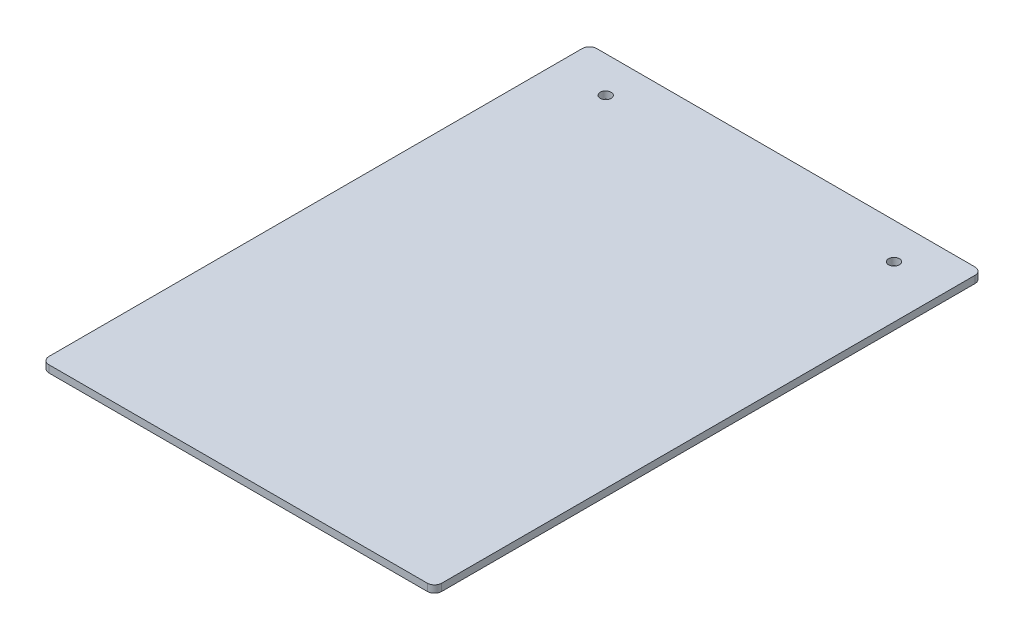
ISO-10303-21;
HEADER;
FILE_DESCRIPTION(('STEP AP214'),'2;1');
FILE_NAME('part.step','',(''),(''),'','','');
FILE_SCHEMA(('AUTOMOTIVE_DESIGN { 1 0 10303 214 1 1 1 1 }'));
ENDSEC;
DATA;
#1=APPLICATION_CONTEXT('core data for automotive mechanical design processes');
#2=APPLICATION_PROTOCOL_DEFINITION('international standard','automotive_design',2000,#1);
#3=PRODUCT_CONTEXT('',#1,'mechanical');
#4=PRODUCT('Part','Part','',(#3));
#5=PRODUCT_RELATED_PRODUCT_CATEGORY('part','',(#4));
#6=PRODUCT_DEFINITION_FORMATION('','',#4);
#7=PRODUCT_DEFINITION_CONTEXT('part definition',#1,'design');
#8=PRODUCT_DEFINITION('design','',#6,#7);
#9=PRODUCT_DEFINITION_SHAPE('','',#8);
#10=(LENGTH_UNIT() NAMED_UNIT(*) SI_UNIT(.MILLI.,.METRE.));
#11=(NAMED_UNIT(*) PLANE_ANGLE_UNIT() SI_UNIT($,.RADIAN.));
#12=(NAMED_UNIT(*) SI_UNIT($,.STERADIAN.) SOLID_ANGLE_UNIT());
#13=UNCERTAINTY_MEASURE_WITH_UNIT(LENGTH_MEASURE(1.E-05),#10,'distance_accuracy_value','');
#14=(GEOMETRIC_REPRESENTATION_CONTEXT(3) GLOBAL_UNCERTAINTY_ASSIGNED_CONTEXT((#13)) GLOBAL_UNIT_ASSIGNED_CONTEXT((#10,
#11,#12)) REPRESENTATION_CONTEXT('',''));
#15=CARTESIAN_POINT('',(0.,0.,0.));
#16=DIRECTION('',(0.,0.,1.));
#17=DIRECTION('',(1.,0.,0.));
#18=AXIS2_PLACEMENT_3D('',#15,#16,#17);
#19=CARTESIAN_POINT('',(173.0375,6.35,241.3));
#20=DIRECTION('',(-1.,0.,0.));
#21=DIRECTION('',(0.,0.,1.));
#22=AXIS2_PLACEMENT_3D('',#19,#20,#21);
#23=PLANE('',#22);
#24=DIRECTION('',(0.,0.,-1.));
#25=VECTOR('',#24,1.);
#26=CARTESIAN_POINT('',(173.0375,0.,241.3));
#27=LINE('',#26,#25);
#28=CARTESIAN_POINT('',(173.0375,0.,234.95));
#29=VERTEX_POINT('',#28);
#30=CARTESIAN_POINT('',(173.0375,0.,-234.95));
#31=VERTEX_POINT('',#30);
#32=EDGE_CURVE('E130',#29,#31,#27,.T.);
#33=ORIENTED_EDGE('',*,*,#32,.T.);
#34=DIRECTION('',(0.,-1.,0.));
#35=VECTOR('',#34,1.);
#36=CARTESIAN_POINT('',(173.0375,6.35,-234.95));
#37=LINE('',#36,#35);
#38=CARTESIAN_POINT('',(173.0375,6.35,-234.95));
#39=VERTEX_POINT('',#38);
#40=EDGE_CURVE('E108',#31,#39,#37,.F.);
#41=ORIENTED_EDGE('',*,*,#40,.T.);
#42=DIRECTION('',(0.,0.,-1.));
#43=VECTOR('',#42,1.);
#44=CARTESIAN_POINT('',(173.0375,6.35,241.3));
#45=LINE('',#44,#43);
#46=CARTESIAN_POINT('',(173.0375,6.35,234.95));
#47=VERTEX_POINT('',#46);
#48=EDGE_CURVE('E140',#47,#39,#45,.T.);
#49=ORIENTED_EDGE('',*,*,#48,.F.);
#50=DIRECTION('',(0.,-1.,0.));
#51=VECTOR('',#50,1.);
#52=CARTESIAN_POINT('',(173.0375,6.35,234.95));
#53=LINE('',#52,#51);
#54=EDGE_CURVE('E113',#47,#29,#53,.T.);
#55=ORIENTED_EDGE('',*,*,#54,.T.);
#56=EDGE_LOOP('',(#33,#41,#49,#55));
#57=FACE_BOUND('',#56,.T.);
#58=ADVANCED_FACE('F37',(#57),#23,.F.);
#59=CARTESIAN_POINT('',(-173.0375,6.35,-241.3));
#60=DIRECTION('',(0.,0.,1.));
#61=DIRECTION('',(1.,0.,0.));
#62=AXIS2_PLACEMENT_3D('',#59,#60,#61);
#63=PLANE('',#62);
#64=DIRECTION('',(-1.,0.,0.));
#65=VECTOR('',#64,1.);
#66=CARTESIAN_POINT('',(-173.0375,6.35,-241.3));
#67=LINE('',#66,#65);
#68=CARTESIAN_POINT('',(166.6875,6.35,-241.3));
#69=VERTEX_POINT('',#68);
#70=CARTESIAN_POINT('',(-166.6875,6.35,-241.3));
#71=VERTEX_POINT('',#70);
#72=EDGE_CURVE('E123',#69,#71,#67,.T.);
#73=ORIENTED_EDGE('',*,*,#72,.F.);
#74=DIRECTION('',(0.,-1.,0.));
#75=VECTOR('',#74,1.);
#76=CARTESIAN_POINT('',(166.6875,6.35,-241.3));
#77=LINE('',#76,#75);
#78=CARTESIAN_POINT('',(166.6875,0.,-241.3));
#79=VERTEX_POINT('',#78);
#80=EDGE_CURVE('E107',#69,#79,#77,.T.);
#81=ORIENTED_EDGE('',*,*,#80,.T.);
#82=DIRECTION('',(-1.,0.,0.));
#83=VECTOR('',#82,1.);
#84=CARTESIAN_POINT('',(-173.0375,0.,-241.3));
#85=LINE('',#84,#83);
#86=CARTESIAN_POINT('',(-166.6875,0.,-241.3));
#87=VERTEX_POINT('',#86);
#88=EDGE_CURVE('E120',#79,#87,#85,.T.);
#89=ORIENTED_EDGE('',*,*,#88,.T.);
#90=DIRECTION('',(0.,-1.,0.));
#91=VECTOR('',#90,1.);
#92=CARTESIAN_POINT('',(-166.6875,6.35,-241.3));
#93=LINE('',#92,#91);
#94=EDGE_CURVE('E125',#87,#71,#93,.F.);
#95=ORIENTED_EDGE('',*,*,#94,.T.);
#96=EDGE_LOOP('',(#73,#81,#89,#95));
#97=FACE_BOUND('',#96,.T.);
#98=ADVANCED_FACE('F119',(#97),#63,.F.);
#99=CARTESIAN_POINT('',(-173.0375,6.35,241.3));
#100=DIRECTION('',(1.,0.,0.));
#101=DIRECTION('',(0.,0.,-1.));
#102=AXIS2_PLACEMENT_3D('',#99,#100,#101);
#103=PLANE('',#102);
#104=DIRECTION('',(0.,0.,1.));
#105=VECTOR('',#104,1.);
#106=CARTESIAN_POINT('',(-173.0375,6.35,241.3));
#107=LINE('',#106,#105);
#108=CARTESIAN_POINT('',(-173.0375,6.35,-234.95));
#109=VERTEX_POINT('',#108);
#110=CARTESIAN_POINT('',(-173.0375,6.35,234.95));
#111=VERTEX_POINT('',#110);
#112=EDGE_CURVE('E166',#109,#111,#107,.T.);
#113=ORIENTED_EDGE('',*,*,#112,.F.);
#114=DIRECTION('',(0.,-1.,0.));
#115=VECTOR('',#114,1.);
#116=CARTESIAN_POINT('',(-173.0375,6.35,-234.95));
#117=LINE('',#116,#115);
#118=CARTESIAN_POINT('',(-173.0375,0.,-234.95));
#119=VERTEX_POINT('',#118);
#120=EDGE_CURVE('E159',#109,#119,#117,.T.);
#121=ORIENTED_EDGE('',*,*,#120,.T.);
#122=DIRECTION('',(0.,0.,1.));
#123=VECTOR('',#122,1.);
#124=CARTESIAN_POINT('',(-173.0375,0.,241.3));
#125=LINE('',#124,#123);
#126=CARTESIAN_POINT('',(-173.0375,0.,234.95));
#127=VERTEX_POINT('',#126);
#128=EDGE_CURVE('E129',#119,#127,#125,.T.);
#129=ORIENTED_EDGE('',*,*,#128,.T.);
#130=DIRECTION('',(0.,-1.,0.));
#131=VECTOR('',#130,1.);
#132=CARTESIAN_POINT('',(-173.0375,6.35,234.95));
#133=LINE('',#132,#131);
#134=EDGE_CURVE('E157',#127,#111,#133,.F.);
#135=ORIENTED_EDGE('',*,*,#134,.T.);
#136=EDGE_LOOP('',(#113,#121,#129,#135));
#137=FACE_BOUND('',#136,.T.);
#138=ADVANCED_FACE('F164',(#137),#103,.F.);
#139=CARTESIAN_POINT('',(-173.0375,6.35,241.3));
#140=DIRECTION('',(0.,0.,-1.));
#141=DIRECTION('',(-1.,0.,0.));
#142=AXIS2_PLACEMENT_3D('',#139,#140,#141);
#143=PLANE('',#142);
#144=DIRECTION('',(1.,0.,0.));
#145=VECTOR('',#144,1.);
#146=CARTESIAN_POINT('',(-173.0375,6.35,241.3));
#147=LINE('',#146,#145);
#148=CARTESIAN_POINT('',(-166.6875,6.35,241.3));
#149=VERTEX_POINT('',#148);
#150=CARTESIAN_POINT('',(166.6875,6.35,241.3));
#151=VERTEX_POINT('',#150);
#152=EDGE_CURVE('E141',#149,#151,#147,.T.);
#153=ORIENTED_EDGE('',*,*,#152,.F.);
#154=DIRECTION('',(0.,-1.,0.));
#155=VECTOR('',#154,1.);
#156=CARTESIAN_POINT('',(-166.6875,6.35,241.3));
#157=LINE('',#156,#155);
#158=CARTESIAN_POINT('',(-166.6875,0.,241.3));
#159=VERTEX_POINT('',#158);
#160=EDGE_CURVE('E11',#149,#159,#157,.T.);
#161=ORIENTED_EDGE('',*,*,#160,.T.);
#162=DIRECTION('',(1.,0.,0.));
#163=VECTOR('',#162,1.);
#164=CARTESIAN_POINT('',(-173.0375,0.,241.3));
#165=LINE('',#164,#163);
#166=CARTESIAN_POINT('',(166.6875,0.,241.3));
#167=VERTEX_POINT('',#166);
#168=EDGE_CURVE('E133',#159,#167,#165,.T.);
#169=ORIENTED_EDGE('',*,*,#168,.T.);
#170=DIRECTION('',(0.,-1.,0.));
#171=VECTOR('',#170,1.);
#172=CARTESIAN_POINT('',(166.6875,6.35,241.3));
#173=LINE('',#172,#171);
#174=EDGE_CURVE('E45',#167,#151,#173,.F.);
#175=ORIENTED_EDGE('',*,*,#174,.T.);
#176=EDGE_LOOP('',(#153,#161,#169,#175));
#177=FACE_BOUND('',#176,.T.);
#178=ADVANCED_FACE('F173',(#177),#143,.F.);
#179=CARTESIAN_POINT('',(0.,6.35,0.));
#180=DIRECTION('',(0.,-1.,0.));
#181=DIRECTION('',(0.,0.,-1.));
#182=AXIS2_PLACEMENT_3D('',#179,#180,#181);
#183=PLANE('',#182);
#184=CARTESIAN_POINT('',(-127.,6.35,-209.55));
#185=DIRECTION('',(0.,1.,0.));
#186=DIRECTION('',(0.,0.,1.));
#187=AXIS2_PLACEMENT_3D('',#184,#185,#186);
#188=CIRCLE('',#187,4.76249999999999);
#189=CARTESIAN_POINT('',(-127.,6.35,-204.7875));
#190=VERTEX_POINT('',#189);
#191=EDGE_CURVE('E188',#190,#190,#188,.T.);
#192=ORIENTED_EDGE('',*,*,#191,.F.);
#193=EDGE_LOOP('',(#192));
#194=FACE_BOUND('',#193,.T.);
#195=CARTESIAN_POINT('',(127.,6.35,-209.55));
#196=DIRECTION('',(0.,1.,0.));
#197=DIRECTION('',(0.,0.,1.));
#198=AXIS2_PLACEMENT_3D('',#195,#196,#197);
#199=CIRCLE('',#198,4.7625);
#200=CARTESIAN_POINT('',(127.,6.35,-204.7875));
#201=VERTEX_POINT('',#200);
#202=EDGE_CURVE('E182',#201,#201,#199,.T.);
#203=ORIENTED_EDGE('',*,*,#202,.F.);
#204=EDGE_LOOP('',(#203));
#205=FACE_BOUND('',#204,.T.);
#206=ORIENTED_EDGE('',*,*,#48,.T.);
#207=CARTESIAN_POINT('',(166.6875,6.35,-234.95));
#208=DIRECTION('',(0.,-1.,0.));
#209=DIRECTION('',(0.,0.,-1.));
#210=AXIS2_PLACEMENT_3D('',#207,#208,#209);
#211=CIRCLE('',#210,6.35);
#212=EDGE_CURVE('E155',#39,#69,#211,.F.);
#213=ORIENTED_EDGE('',*,*,#212,.T.);
#214=ORIENTED_EDGE('',*,*,#72,.T.);
#215=CARTESIAN_POINT('',(-166.6875,6.35,-234.95));
#216=DIRECTION('',(0.,-1.,0.));
#217=DIRECTION('',(0.,0.,-1.));
#218=AXIS2_PLACEMENT_3D('',#215,#216,#217);
#219=CIRCLE('',#218,6.35);
#220=EDGE_CURVE('E153',#71,#109,#219,.F.);
#221=ORIENTED_EDGE('',*,*,#220,.T.);
#222=ORIENTED_EDGE('',*,*,#112,.T.);
#223=CARTESIAN_POINT('',(-166.6875,6.35,234.95));
#224=DIRECTION('',(0.,-1.,0.));
#225=DIRECTION('',(0.,0.,-1.));
#226=AXIS2_PLACEMENT_3D('',#223,#224,#225);
#227=CIRCLE('',#226,6.35);
#228=EDGE_CURVE('E58',#111,#149,#227,.F.);
#229=ORIENTED_EDGE('',*,*,#228,.T.);
#230=ORIENTED_EDGE('',*,*,#152,.T.);
#231=CARTESIAN_POINT('',(166.6875,6.35,234.95));
#232=DIRECTION('',(0.,-1.,0.));
#233=DIRECTION('',(0.,0.,-1.));
#234=AXIS2_PLACEMENT_3D('',#231,#232,#233);
#235=CIRCLE('',#234,6.35);
#236=EDGE_CURVE('E150',#151,#47,#235,.F.);
#237=ORIENTED_EDGE('',*,*,#236,.T.);
#238=EDGE_LOOP('',(#206,#213,#214,#221,#222,#229,#230,#237));
#239=FACE_BOUND('',#238,.T.);
#240=ADVANCED_FACE('F194',(#194,#205,#239),#183,.F.);
#241=CARTESIAN_POINT('',(0.,0.,0.));
#242=DIRECTION('',(0.,-1.,0.));
#243=DIRECTION('',(0.,0.,-1.));
#244=AXIS2_PLACEMENT_3D('',#241,#242,#243);
#245=PLANE('',#244);
#246=CARTESIAN_POINT('',(-127.,0.,-209.55));
#247=DIRECTION('',(0.,1.,0.));
#248=DIRECTION('',(0.,0.,1.));
#249=AXIS2_PLACEMENT_3D('',#246,#247,#248);
#250=CIRCLE('',#249,4.76249999999999);
#251=CARTESIAN_POINT('',(-127.,0.,-204.7875));
#252=VERTEX_POINT('',#251);
#253=EDGE_CURVE('E185',#252,#252,#250,.T.);
#254=ORIENTED_EDGE('',*,*,#253,.T.);
#255=EDGE_LOOP('',(#254));
#256=FACE_BOUND('',#255,.T.);
#257=CARTESIAN_POINT('',(127.,0.,-209.55));
#258=DIRECTION('',(0.,1.,0.));
#259=DIRECTION('',(0.,0.,1.));
#260=AXIS2_PLACEMENT_3D('',#257,#258,#259);
#261=CIRCLE('',#260,4.7625);
#262=CARTESIAN_POINT('',(127.,0.,-204.7875));
#263=VERTEX_POINT('',#262);
#264=EDGE_CURVE('E135',#263,#263,#261,.T.);
#265=ORIENTED_EDGE('',*,*,#264,.T.);
#266=EDGE_LOOP('',(#265));
#267=FACE_BOUND('',#266,.T.);
#268=ORIENTED_EDGE('',*,*,#88,.F.);
#269=CARTESIAN_POINT('',(166.6875,0.,-234.95));
#270=DIRECTION('',(0.,-1.,0.));
#271=DIRECTION('',(0.,0.,-1.));
#272=AXIS2_PLACEMENT_3D('',#269,#270,#271);
#273=CIRCLE('',#272,6.35);
#274=EDGE_CURVE('E103',#79,#31,#273,.T.);
#275=ORIENTED_EDGE('',*,*,#274,.T.);
#276=ORIENTED_EDGE('',*,*,#32,.F.);
#277=CARTESIAN_POINT('',(166.6875,0.,234.95));
#278=DIRECTION('',(0.,-1.,0.));
#279=DIRECTION('',(0.,0.,-1.));
#280=AXIS2_PLACEMENT_3D('',#277,#278,#279);
#281=CIRCLE('',#280,6.35);
#282=EDGE_CURVE('E124',#29,#167,#281,.T.);
#283=ORIENTED_EDGE('',*,*,#282,.T.);
#284=ORIENTED_EDGE('',*,*,#168,.F.);
#285=CARTESIAN_POINT('',(-166.6875,0.,234.95));
#286=DIRECTION('',(0.,-1.,0.));
#287=DIRECTION('',(0.,0.,-1.));
#288=AXIS2_PLACEMENT_3D('',#285,#286,#287);
#289=CIRCLE('',#288,6.35);
#290=EDGE_CURVE('E144',#159,#127,#289,.T.);
#291=ORIENTED_EDGE('',*,*,#290,.T.);
#292=ORIENTED_EDGE('',*,*,#128,.F.);
#293=CARTESIAN_POINT('',(-166.6875,0.,-234.95));
#294=DIRECTION('',(0.,-1.,0.));
#295=DIRECTION('',(0.,0.,-1.));
#296=AXIS2_PLACEMENT_3D('',#293,#294,#295);
#297=CIRCLE('',#296,6.35);
#298=EDGE_CURVE('E114',#119,#87,#297,.T.);
#299=ORIENTED_EDGE('',*,*,#298,.T.);
#300=EDGE_LOOP('',(#268,#275,#276,#283,#284,#291,#292,#299));
#301=FACE_BOUND('',#300,.T.);
#302=ADVANCED_FACE('F127',(#256,#267,#301),#245,.T.);
#303=CARTESIAN_POINT('',(166.6875,6.35,-234.95));
#304=DIRECTION('',(0.,-1.,0.));
#305=DIRECTION('',(0.,0.,-1.));
#306=AXIS2_PLACEMENT_3D('',#303,#304,#305);
#307=CYLINDRICAL_SURFACE('',#306,6.35);
#308=ORIENTED_EDGE('',*,*,#212,.F.);
#309=ORIENTED_EDGE('',*,*,#40,.F.);
#310=ORIENTED_EDGE('',*,*,#274,.F.);
#311=ORIENTED_EDGE('',*,*,#80,.F.);
#312=EDGE_LOOP('',(#308,#309,#310,#311));
#313=FACE_BOUND('',#312,.T.);
#314=ADVANCED_FACE('F106',(#313),#307,.T.);
#315=CARTESIAN_POINT('',(-166.6875,6.35,-234.95));
#316=DIRECTION('',(0.,-1.,0.));
#317=DIRECTION('',(0.,0.,-1.));
#318=AXIS2_PLACEMENT_3D('',#315,#316,#317);
#319=CYLINDRICAL_SURFACE('',#318,6.35);
#320=ORIENTED_EDGE('',*,*,#220,.F.);
#321=ORIENTED_EDGE('',*,*,#94,.F.);
#322=ORIENTED_EDGE('',*,*,#298,.F.);
#323=ORIENTED_EDGE('',*,*,#120,.F.);
#324=EDGE_LOOP('',(#320,#321,#322,#323));
#325=FACE_BOUND('',#324,.T.);
#326=ADVANCED_FACE('F211',(#325),#319,.T.);
#327=CARTESIAN_POINT('',(-166.6875,6.35,234.95));
#328=DIRECTION('',(0.,-1.,0.));
#329=DIRECTION('',(0.,0.,-1.));
#330=AXIS2_PLACEMENT_3D('',#327,#328,#329);
#331=CYLINDRICAL_SURFACE('',#330,6.35);
#332=ORIENTED_EDGE('',*,*,#228,.F.);
#333=ORIENTED_EDGE('',*,*,#134,.F.);
#334=ORIENTED_EDGE('',*,*,#290,.F.);
#335=ORIENTED_EDGE('',*,*,#160,.F.);
#336=EDGE_LOOP('',(#332,#333,#334,#335));
#337=FACE_BOUND('',#336,.T.);
#338=ADVANCED_FACE('F172',(#337),#331,.T.);
#339=CARTESIAN_POINT('',(166.6875,6.35,234.95));
#340=DIRECTION('',(0.,-1.,0.));
#341=DIRECTION('',(0.,0.,-1.));
#342=AXIS2_PLACEMENT_3D('',#339,#340,#341);
#343=CYLINDRICAL_SURFACE('',#342,6.35);
#344=ORIENTED_EDGE('',*,*,#236,.F.);
#345=ORIENTED_EDGE('',*,*,#174,.F.);
#346=ORIENTED_EDGE('',*,*,#282,.F.);
#347=ORIENTED_EDGE('',*,*,#54,.F.);
#348=EDGE_LOOP('',(#344,#345,#346,#347));
#349=FACE_BOUND('',#348,.T.);
#350=ADVANCED_FACE('F39',(#349),#343,.T.);
#351=CARTESIAN_POINT('',(127.,6.35,-209.55));
#352=DIRECTION('',(0.,1.,0.));
#353=DIRECTION('',(0.,0.,1.));
#354=AXIS2_PLACEMENT_3D('',#351,#352,#353);
#355=CYLINDRICAL_SURFACE('',#354,4.7625);
#356=ORIENTED_EDGE('',*,*,#264,.F.);
#357=EDGE_LOOP('',(#356));
#358=FACE_BOUND('',#357,.T.);
#359=ORIENTED_EDGE('',*,*,#202,.T.);
#360=EDGE_LOOP('',(#359));
#361=FACE_BOUND('',#360,.T.);
#362=ADVANCED_FACE('F204',(#358,#361),#355,.F.);
#363=CARTESIAN_POINT('',(-127.,6.35,-209.55));
#364=DIRECTION('',(0.,1.,0.));
#365=DIRECTION('',(0.,0.,1.));
#366=AXIS2_PLACEMENT_3D('',#363,#364,#365);
#367=CYLINDRICAL_SURFACE('',#366,4.76249999999999);
#368=ORIENTED_EDGE('',*,*,#253,.F.);
#369=EDGE_LOOP('',(#368));
#370=FACE_BOUND('',#369,.T.);
#371=ORIENTED_EDGE('',*,*,#191,.T.);
#372=EDGE_LOOP('',(#371));
#373=FACE_BOUND('',#372,.T.);
#374=ADVANCED_FACE('F192',(#370,#373),#367,.F.);
#375=CLOSED_SHELL('',(#58,#98,#138,#178,#240,#302,#314,#326,#338,#350,#362,#374));
#376=MANIFOLD_SOLID_BREP('B2',#375);
#377=ADVANCED_BREP_SHAPE_REPRESENTATION('',(#18,#376),#14);
#378=SHAPE_DEFINITION_REPRESENTATION(#9,#377);
ENDSEC;
END-ISO-10303-21;
